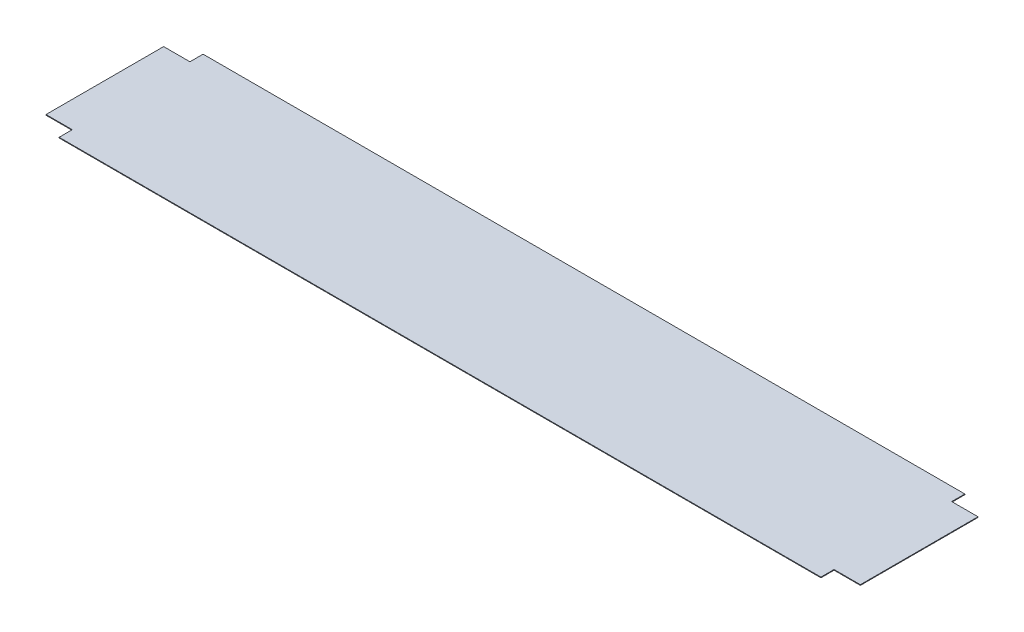
ISO-10303-21;
HEADER;
FILE_DESCRIPTION(('STEP AP214'),'2;1');
FILE_NAME('part.step','',(''),(''),'','','');
FILE_SCHEMA(('AUTOMOTIVE_DESIGN { 1 0 10303 214 1 1 1 1 }'));
ENDSEC;
DATA;
#1=APPLICATION_CONTEXT('core data for automotive mechanical design processes');
#2=APPLICATION_PROTOCOL_DEFINITION('international standard','automotive_design',2000,#1);
#3=PRODUCT_CONTEXT('',#1,'mechanical');
#4=PRODUCT('Part','Part','',(#3));
#5=PRODUCT_RELATED_PRODUCT_CATEGORY('part','',(#4));
#6=PRODUCT_DEFINITION_FORMATION('','',#4);
#7=PRODUCT_DEFINITION_CONTEXT('part definition',#1,'design');
#8=PRODUCT_DEFINITION('design','',#6,#7);
#9=PRODUCT_DEFINITION_SHAPE('','',#8);
#10=(LENGTH_UNIT() NAMED_UNIT(*) SI_UNIT(.MILLI.,.METRE.));
#11=(NAMED_UNIT(*) PLANE_ANGLE_UNIT() SI_UNIT($,.RADIAN.));
#12=(NAMED_UNIT(*) SI_UNIT($,.STERADIAN.) SOLID_ANGLE_UNIT());
#13=UNCERTAINTY_MEASURE_WITH_UNIT(LENGTH_MEASURE(1.E-05),#10,'distance_accuracy_value','');
#14=(GEOMETRIC_REPRESENTATION_CONTEXT(3) GLOBAL_UNCERTAINTY_ASSIGNED_CONTEXT((#13)) GLOBAL_UNIT_ASSIGNED_CONTEXT((#10,
#11,#12)) REPRESENTATION_CONTEXT('',''));
#15=CARTESIAN_POINT('',(0.,0.,0.));
#16=DIRECTION('',(0.,0.,1.));
#17=DIRECTION('',(1.,0.,0.));
#18=AXIS2_PLACEMENT_3D('',#15,#16,#17);
#19=CARTESIAN_POINT('',(-579.5,-1.,-109.5));
#20=DIRECTION('',(0.,0.,-1.));
#21=DIRECTION('',(-1.,0.,0.));
#22=AXIS2_PLACEMENT_3D('',#19,#20,#21);
#23=PLANE('',#22);
#24=DIRECTION('',(-1.,0.,0.));
#25=VECTOR('',#24,1.);
#26=CARTESIAN_POINT('',(-579.5,0.,-109.5));
#27=LINE('',#26,#25);
#28=CARTESIAN_POINT('',(579.5,0.,-109.5));
#29=VERTEX_POINT('',#28);
#30=CARTESIAN_POINT('',(-579.5,0.,-109.5));
#31=VERTEX_POINT('',#30);
#32=EDGE_CURVE('E161',#29,#31,#27,.T.);
#33=ORIENTED_EDGE('',*,*,#32,.F.);
#34=DIRECTION('',(0.,1.,0.));
#35=VECTOR('',#34,1.);
#36=CARTESIAN_POINT('',(579.5,-1.,-109.5));
#37=LINE('',#36,#35);
#38=CARTESIAN_POINT('',(579.5,-1.,-109.5));
#39=VERTEX_POINT('',#38);
#40=EDGE_CURVE('E11',#39,#29,#37,.T.);
#41=ORIENTED_EDGE('',*,*,#40,.F.);
#42=DIRECTION('',(-1.,0.,0.));
#43=VECTOR('',#42,1.);
#44=CARTESIAN_POINT('',(-579.5,-1.,-109.5));
#45=LINE('',#44,#43);
#46=CARTESIAN_POINT('',(-579.5,-1.,-109.5));
#47=VERTEX_POINT('',#46);
#48=EDGE_CURVE('E193',#39,#47,#45,.T.);
#49=ORIENTED_EDGE('',*,*,#48,.T.);
#50=DIRECTION('',(0.,1.,0.));
#51=VECTOR('',#50,1.);
#52=CARTESIAN_POINT('',(-579.5,-1.,-109.5));
#53=LINE('',#52,#51);
#54=EDGE_CURVE('E43',#47,#31,#53,.T.);
#55=ORIENTED_EDGE('',*,*,#54,.T.);
#56=EDGE_LOOP('',(#33,#41,#49,#55));
#57=FACE_BOUND('',#56,.T.);
#58=ADVANCED_FACE('F40',(#57),#23,.T.);
#59=CARTESIAN_POINT('',(579.5,-1.,-109.5));
#60=DIRECTION('',(1.,0.,0.));
#61=DIRECTION('',(0.,0.,-1.));
#62=AXIS2_PLACEMENT_3D('',#59,#60,#61);
#63=PLANE('',#62);
#64=DIRECTION('',(0.,0.,-1.));
#65=VECTOR('',#64,1.);
#66=CARTESIAN_POINT('',(579.5,0.,-109.5));
#67=LINE('',#66,#65);
#68=CARTESIAN_POINT('',(579.5,0.,-89.5000000000004));
#69=VERTEX_POINT('',#68);
#70=EDGE_CURVE('E191',#69,#29,#67,.T.);
#71=ORIENTED_EDGE('',*,*,#70,.F.);
#72=DIRECTION('',(0.,1.,0.));
#73=VECTOR('',#72,1.);
#74=CARTESIAN_POINT('',(579.5,-1.,-89.5000000000004));
#75=LINE('',#74,#73);
#76=CARTESIAN_POINT('',(579.5,-1.,-89.5000000000004));
#77=VERTEX_POINT('',#76);
#78=EDGE_CURVE('E49',#77,#69,#75,.T.);
#79=ORIENTED_EDGE('',*,*,#78,.F.);
#80=DIRECTION('',(0.,0.,-1.));
#81=VECTOR('',#80,1.);
#82=CARTESIAN_POINT('',(579.5,-1.,-109.5));
#83=LINE('',#82,#81);
#84=EDGE_CURVE('E151',#77,#39,#83,.T.);
#85=ORIENTED_EDGE('',*,*,#84,.T.);
#86=ORIENTED_EDGE('',*,*,#40,.T.);
#87=EDGE_LOOP('',(#71,#79,#85,#86));
#88=FACE_BOUND('',#87,.T.);
#89=ADVANCED_FACE('F213',(#88),#63,.T.);
#90=CARTESIAN_POINT('',(579.5,-1.,-89.5000000000004));
#91=DIRECTION('',(0.,0.,-1.));
#92=DIRECTION('',(-1.,0.,0.));
#93=AXIS2_PLACEMENT_3D('',#90,#91,#92);
#94=PLANE('',#93);
#95=DIRECTION('',(-1.,0.,0.));
#96=VECTOR('',#95,1.);
#97=CARTESIAN_POINT('',(579.5,0.,-89.5000000000004));
#98=LINE('',#97,#96);
#99=CARTESIAN_POINT('',(619.5,0.,-89.4999999999996));
#100=VERTEX_POINT('',#99);
#101=EDGE_CURVE('E138',#100,#69,#98,.T.);
#102=ORIENTED_EDGE('',*,*,#101,.F.);
#103=DIRECTION('',(0.,1.,0.));
#104=VECTOR('',#103,1.);
#105=CARTESIAN_POINT('',(619.5,-1.,-89.4999999999996));
#106=LINE('',#105,#104);
#107=CARTESIAN_POINT('',(619.5,-1.,-89.4999999999996));
#108=VERTEX_POINT('',#107);
#109=EDGE_CURVE('E133',#108,#100,#106,.T.);
#110=ORIENTED_EDGE('',*,*,#109,.F.);
#111=DIRECTION('',(-1.,0.,0.));
#112=VECTOR('',#111,1.);
#113=CARTESIAN_POINT('',(579.5,-1.,-89.5000000000004));
#114=LINE('',#113,#112);
#115=EDGE_CURVE('E136',#108,#77,#114,.T.);
#116=ORIENTED_EDGE('',*,*,#115,.T.);
#117=ORIENTED_EDGE('',*,*,#78,.T.);
#118=EDGE_LOOP('',(#102,#110,#116,#117));
#119=FACE_BOUND('',#118,.T.);
#120=ADVANCED_FACE('F135',(#119),#94,.T.);
#121=CARTESIAN_POINT('',(619.5,-1.,89.4999999999999));
#122=DIRECTION('',(1.,0.,0.));
#123=DIRECTION('',(0.,0.,-1.));
#124=AXIS2_PLACEMENT_3D('',#121,#122,#123);
#125=PLANE('',#124);
#126=DIRECTION('',(0.,0.,-1.));
#127=VECTOR('',#126,1.);
#128=CARTESIAN_POINT('',(619.5,0.,89.4999999999999));
#129=LINE('',#128,#127);
#130=CARTESIAN_POINT('',(619.5,0.,89.4999999999999));
#131=VERTEX_POINT('',#130);
#132=EDGE_CURVE('E188',#131,#100,#129,.T.);
#133=ORIENTED_EDGE('',*,*,#132,.F.);
#134=DIRECTION('',(0.,1.,0.));
#135=VECTOR('',#134,1.);
#136=CARTESIAN_POINT('',(619.5,-1.,89.4999999999999));
#137=LINE('',#136,#135);
#138=CARTESIAN_POINT('',(619.5,-1.,89.4999999999999));
#139=VERTEX_POINT('',#138);
#140=EDGE_CURVE('E143',#139,#131,#137,.T.);
#141=ORIENTED_EDGE('',*,*,#140,.F.);
#142=DIRECTION('',(0.,0.,-1.));
#143=VECTOR('',#142,1.);
#144=CARTESIAN_POINT('',(619.5,-1.,89.4999999999999));
#145=LINE('',#144,#143);
#146=EDGE_CURVE('E149',#139,#108,#145,.T.);
#147=ORIENTED_EDGE('',*,*,#146,.T.);
#148=ORIENTED_EDGE('',*,*,#109,.T.);
#149=EDGE_LOOP('',(#133,#141,#147,#148));
#150=FACE_BOUND('',#149,.T.);
#151=ADVANCED_FACE('F153',(#150),#125,.T.);
#152=CARTESIAN_POINT('',(579.5,-1.,89.4999999999999));
#153=DIRECTION('',(0.,0.,1.));
#154=DIRECTION('',(1.,0.,0.));
#155=AXIS2_PLACEMENT_3D('',#152,#153,#154);
#156=PLANE('',#155);
#157=DIRECTION('',(1.,0.,0.));
#158=VECTOR('',#157,1.);
#159=CARTESIAN_POINT('',(579.5,0.,89.4999999999999));
#160=LINE('',#159,#158);
#161=CARTESIAN_POINT('',(579.5,0.,89.4999999999999));
#162=VERTEX_POINT('',#161);
#163=EDGE_CURVE('E185',#162,#131,#160,.T.);
#164=ORIENTED_EDGE('',*,*,#163,.F.);
#165=DIRECTION('',(0.,1.,0.));
#166=VECTOR('',#165,1.);
#167=CARTESIAN_POINT('',(579.5,-1.,89.4999999999999));
#168=LINE('',#167,#166);
#169=CARTESIAN_POINT('',(579.5,-1.,89.4999999999999));
#170=VERTEX_POINT('',#169);
#171=EDGE_CURVE('E197',#170,#162,#168,.T.);
#172=ORIENTED_EDGE('',*,*,#171,.F.);
#173=DIRECTION('',(1.,0.,0.));
#174=VECTOR('',#173,1.);
#175=CARTESIAN_POINT('',(579.5,-1.,89.4999999999999));
#176=LINE('',#175,#174);
#177=EDGE_CURVE('E154',#170,#139,#176,.T.);
#178=ORIENTED_EDGE('',*,*,#177,.T.);
#179=ORIENTED_EDGE('',*,*,#140,.T.);
#180=EDGE_LOOP('',(#164,#172,#178,#179));
#181=FACE_BOUND('',#180,.T.);
#182=ADVANCED_FACE('F226',(#181),#156,.T.);
#183=CARTESIAN_POINT('',(579.5,-1.,109.5));
#184=DIRECTION('',(1.,0.,0.));
#185=DIRECTION('',(0.,0.,-1.));
#186=AXIS2_PLACEMENT_3D('',#183,#184,#185);
#187=PLANE('',#186);
#188=DIRECTION('',(0.,0.,-1.));
#189=VECTOR('',#188,1.);
#190=CARTESIAN_POINT('',(579.5,0.,109.5));
#191=LINE('',#190,#189);
#192=CARTESIAN_POINT('',(579.5,0.,109.5));
#193=VERTEX_POINT('',#192);
#194=EDGE_CURVE('E182',#193,#162,#191,.T.);
#195=ORIENTED_EDGE('',*,*,#194,.F.);
#196=DIRECTION('',(0.,1.,0.));
#197=VECTOR('',#196,1.);
#198=CARTESIAN_POINT('',(579.5,-1.,109.5));
#199=LINE('',#198,#197);
#200=CARTESIAN_POINT('',(579.5,-1.,109.5));
#201=VERTEX_POINT('',#200);
#202=EDGE_CURVE('E199',#201,#193,#199,.T.);
#203=ORIENTED_EDGE('',*,*,#202,.F.);
#204=DIRECTION('',(0.,0.,-1.));
#205=VECTOR('',#204,1.);
#206=CARTESIAN_POINT('',(579.5,-1.,109.5));
#207=LINE('',#206,#205);
#208=EDGE_CURVE('E156',#201,#170,#207,.T.);
#209=ORIENTED_EDGE('',*,*,#208,.T.);
#210=ORIENTED_EDGE('',*,*,#171,.T.);
#211=EDGE_LOOP('',(#195,#203,#209,#210));
#212=FACE_BOUND('',#211,.T.);
#213=ADVANCED_FACE('F229',(#212),#187,.T.);
#214=CARTESIAN_POINT('',(-579.5,-1.,109.5));
#215=DIRECTION('',(0.,0.,1.));
#216=DIRECTION('',(1.,0.,0.));
#217=AXIS2_PLACEMENT_3D('',#214,#215,#216);
#218=PLANE('',#217);
#219=DIRECTION('',(1.,0.,0.));
#220=VECTOR('',#219,1.);
#221=CARTESIAN_POINT('',(-579.5,0.,109.5));
#222=LINE('',#221,#220);
#223=CARTESIAN_POINT('',(-579.5,0.,109.5));
#224=VERTEX_POINT('',#223);
#225=EDGE_CURVE('E179',#224,#193,#222,.T.);
#226=ORIENTED_EDGE('',*,*,#225,.F.);
#227=DIRECTION('',(0.,1.,0.));
#228=VECTOR('',#227,1.);
#229=CARTESIAN_POINT('',(-579.5,-1.,109.5));
#230=LINE('',#229,#228);
#231=CARTESIAN_POINT('',(-579.5,-1.,109.5));
#232=VERTEX_POINT('',#231);
#233=EDGE_CURVE('E201',#232,#224,#230,.T.);
#234=ORIENTED_EDGE('',*,*,#233,.F.);
#235=DIRECTION('',(1.,0.,0.));
#236=VECTOR('',#235,1.);
#237=CARTESIAN_POINT('',(-579.5,-1.,109.5));
#238=LINE('',#237,#236);
#239=EDGE_CURVE('E383',#232,#201,#238,.T.);
#240=ORIENTED_EDGE('',*,*,#239,.T.);
#241=ORIENTED_EDGE('',*,*,#202,.T.);
#242=EDGE_LOOP('',(#226,#234,#240,#241));
#243=FACE_BOUND('',#242,.T.);
#244=ADVANCED_FACE('F233',(#243),#218,.T.);
#245=CARTESIAN_POINT('',(-579.5,-1.,109.5));
#246=DIRECTION('',(-1.,0.,0.));
#247=DIRECTION('',(0.,0.,1.));
#248=AXIS2_PLACEMENT_3D('',#245,#246,#247);
#249=PLANE('',#248);
#250=DIRECTION('',(0.,0.,1.));
#251=VECTOR('',#250,1.);
#252=CARTESIAN_POINT('',(-579.5,0.,109.5));
#253=LINE('',#252,#251);
#254=CARTESIAN_POINT('',(-579.5,0.,89.4999999999999));
#255=VERTEX_POINT('',#254);
#256=EDGE_CURVE('E176',#255,#224,#253,.T.);
#257=ORIENTED_EDGE('',*,*,#256,.F.);
#258=DIRECTION('',(0.,1.,0.));
#259=VECTOR('',#258,1.);
#260=CARTESIAN_POINT('',(-579.5,-1.,89.4999999999999));
#261=LINE('',#260,#259);
#262=CARTESIAN_POINT('',(-579.5,-1.,89.4999999999999));
#263=VERTEX_POINT('',#262);
#264=EDGE_CURVE('E203',#263,#255,#261,.T.);
#265=ORIENTED_EDGE('',*,*,#264,.F.);
#266=DIRECTION('',(0.,0.,1.));
#267=VECTOR('',#266,1.);
#268=CARTESIAN_POINT('',(-579.5,-1.,109.5));
#269=LINE('',#268,#267);
#270=EDGE_CURVE('E387',#263,#232,#269,.T.);
#271=ORIENTED_EDGE('',*,*,#270,.T.);
#272=ORIENTED_EDGE('',*,*,#233,.T.);
#273=EDGE_LOOP('',(#257,#265,#271,#272));
#274=FACE_BOUND('',#273,.T.);
#275=ADVANCED_FACE('F237',(#274),#249,.T.);
#276=CARTESIAN_POINT('',(-579.5,-1.,89.4999999999999));
#277=DIRECTION('',(0.,0.,1.));
#278=DIRECTION('',(1.,0.,0.));
#279=AXIS2_PLACEMENT_3D('',#276,#277,#278);
#280=PLANE('',#279);
#281=DIRECTION('',(1.,0.,0.));
#282=VECTOR('',#281,1.);
#283=CARTESIAN_POINT('',(-579.5,0.,89.4999999999999));
#284=LINE('',#283,#282);
#285=CARTESIAN_POINT('',(-619.5,0.,89.4999999999999));
#286=VERTEX_POINT('',#285);
#287=EDGE_CURVE('E173',#286,#255,#284,.T.);
#288=ORIENTED_EDGE('',*,*,#287,.F.);
#289=DIRECTION('',(0.,1.,0.));
#290=VECTOR('',#289,1.);
#291=CARTESIAN_POINT('',(-619.5,-1.,89.4999999999999));
#292=LINE('',#291,#290);
#293=CARTESIAN_POINT('',(-619.5,-1.,89.4999999999999));
#294=VERTEX_POINT('',#293);
#295=EDGE_CURVE('E205',#294,#286,#292,.T.);
#296=ORIENTED_EDGE('',*,*,#295,.F.);
#297=DIRECTION('',(1.,0.,0.));
#298=VECTOR('',#297,1.);
#299=CARTESIAN_POINT('',(-579.5,-1.,89.4999999999999));
#300=LINE('',#299,#298);
#301=EDGE_CURVE('E376',#294,#263,#300,.T.);
#302=ORIENTED_EDGE('',*,*,#301,.T.);
#303=ORIENTED_EDGE('',*,*,#264,.T.);
#304=EDGE_LOOP('',(#288,#296,#302,#303));
#305=FACE_BOUND('',#304,.T.);
#306=ADVANCED_FACE('F241',(#305),#280,.T.);
#307=CARTESIAN_POINT('',(-619.5,-1.,89.4999999999999));
#308=DIRECTION('',(-1.,0.,0.));
#309=DIRECTION('',(0.,0.,1.));
#310=AXIS2_PLACEMENT_3D('',#307,#308,#309);
#311=PLANE('',#310);
#312=DIRECTION('',(0.,0.,1.));
#313=VECTOR('',#312,1.);
#314=CARTESIAN_POINT('',(-619.5,0.,89.4999999999999));
#315=LINE('',#314,#313);
#316=CARTESIAN_POINT('',(-619.5,0.,-89.4999999999996));
#317=VERTEX_POINT('',#316);
#318=EDGE_CURVE('E170',#317,#286,#315,.T.);
#319=ORIENTED_EDGE('',*,*,#318,.F.);
#320=DIRECTION('',(0.,1.,0.));
#321=VECTOR('',#320,1.);
#322=CARTESIAN_POINT('',(-619.5,-1.,-89.4999999999996));
#323=LINE('',#322,#321);
#324=CARTESIAN_POINT('',(-619.5,-1.,-89.4999999999996));
#325=VERTEX_POINT('',#324);
#326=EDGE_CURVE('E207',#325,#317,#323,.T.);
#327=ORIENTED_EDGE('',*,*,#326,.F.);
#328=DIRECTION('',(0.,0.,1.));
#329=VECTOR('',#328,1.);
#330=CARTESIAN_POINT('',(-619.5,-1.,89.4999999999999));
#331=LINE('',#330,#329);
#332=EDGE_CURVE('E372',#325,#294,#331,.T.);
#333=ORIENTED_EDGE('',*,*,#332,.T.);
#334=ORIENTED_EDGE('',*,*,#295,.T.);
#335=EDGE_LOOP('',(#319,#327,#333,#334));
#336=FACE_BOUND('',#335,.T.);
#337=ADVANCED_FACE('F245',(#336),#311,.T.);
#338=CARTESIAN_POINT('',(-579.5,-1.,-89.4999999999996));
#339=DIRECTION('',(0.,0.,-1.));
#340=DIRECTION('',(-1.,0.,0.));
#341=AXIS2_PLACEMENT_3D('',#338,#339,#340);
#342=PLANE('',#341);
#343=DIRECTION('',(-1.,0.,0.));
#344=VECTOR('',#343,1.);
#345=CARTESIAN_POINT('',(-579.5,0.,-89.4999999999996));
#346=LINE('',#345,#344);
#347=CARTESIAN_POINT('',(-579.5,0.,-89.4999999999996));
#348=VERTEX_POINT('',#347);
#349=EDGE_CURVE('E167',#348,#317,#346,.T.);
#350=ORIENTED_EDGE('',*,*,#349,.F.);
#351=DIRECTION('',(0.,1.,0.));
#352=VECTOR('',#351,1.);
#353=CARTESIAN_POINT('',(-579.5,-1.,-89.4999999999996));
#354=LINE('',#353,#352);
#355=CARTESIAN_POINT('',(-579.5,-1.,-89.4999999999996));
#356=VERTEX_POINT('',#355);
#357=EDGE_CURVE('E208',#356,#348,#354,.T.);
#358=ORIENTED_EDGE('',*,*,#357,.F.);
#359=DIRECTION('',(-1.,0.,0.));
#360=VECTOR('',#359,1.);
#361=CARTESIAN_POINT('',(-579.5,-1.,-89.4999999999996));
#362=LINE('',#361,#360);
#363=EDGE_CURVE('E393',#356,#325,#362,.T.);
#364=ORIENTED_EDGE('',*,*,#363,.T.);
#365=ORIENTED_EDGE('',*,*,#326,.T.);
#366=EDGE_LOOP('',(#350,#358,#364,#365));
#367=FACE_BOUND('',#366,.T.);
#368=ADVANCED_FACE('F249',(#367),#342,.T.);
#369=CARTESIAN_POINT('',(-579.5,-1.,-109.5));
#370=DIRECTION('',(-1.,0.,0.));
#371=DIRECTION('',(0.,0.,1.));
#372=AXIS2_PLACEMENT_3D('',#369,#370,#371);
#373=PLANE('',#372);
#374=DIRECTION('',(0.,0.,1.));
#375=VECTOR('',#374,1.);
#376=CARTESIAN_POINT('',(-579.5,0.,-109.5));
#377=LINE('',#376,#375);
#378=EDGE_CURVE('E164',#31,#348,#377,.T.);
#379=ORIENTED_EDGE('',*,*,#378,.F.);
#380=ORIENTED_EDGE('',*,*,#54,.F.);
#381=DIRECTION('',(0.,0.,1.));
#382=VECTOR('',#381,1.);
#383=CARTESIAN_POINT('',(-579.5,-1.,-109.5));
#384=LINE('',#383,#382);
#385=EDGE_CURVE('E395',#47,#356,#384,.T.);
#386=ORIENTED_EDGE('',*,*,#385,.T.);
#387=ORIENTED_EDGE('',*,*,#357,.T.);
#388=EDGE_LOOP('',(#379,#380,#386,#387));
#389=FACE_BOUND('',#388,.T.);
#390=ADVANCED_FACE('F210',(#389),#373,.T.);
#391=CARTESIAN_POINT('',(0.,-1.,0.));
#392=DIRECTION('',(0.,-1.,0.));
#393=DIRECTION('',(0.,0.,-1.));
#394=AXIS2_PLACEMENT_3D('',#391,#392,#393);
#395=PLANE('',#394);
#396=ORIENTED_EDGE('',*,*,#48,.F.);
#397=ORIENTED_EDGE('',*,*,#84,.F.);
#398=ORIENTED_EDGE('',*,*,#115,.F.);
#399=ORIENTED_EDGE('',*,*,#146,.F.);
#400=ORIENTED_EDGE('',*,*,#177,.F.);
#401=ORIENTED_EDGE('',*,*,#208,.F.);
#402=ORIENTED_EDGE('',*,*,#239,.F.);
#403=ORIENTED_EDGE('',*,*,#270,.F.);
#404=ORIENTED_EDGE('',*,*,#301,.F.);
#405=ORIENTED_EDGE('',*,*,#332,.F.);
#406=ORIENTED_EDGE('',*,*,#363,.F.);
#407=ORIENTED_EDGE('',*,*,#385,.F.);
#408=EDGE_LOOP('',(#396,#397,#398,#399,#400,#401,#402,#403,#404,#405,#406,#407));
#409=FACE_BOUND('',#408,.T.);
#410=ADVANCED_FACE('F147',(#409),#395,.T.);
#411=CARTESIAN_POINT('',(0.,0.,0.));
#412=DIRECTION('',(0.,-1.,0.));
#413=DIRECTION('',(0.,0.,-1.));
#414=AXIS2_PLACEMENT_3D('',#411,#412,#413);
#415=PLANE('',#414);
#416=ORIENTED_EDGE('',*,*,#32,.T.);
#417=ORIENTED_EDGE('',*,*,#378,.T.);
#418=ORIENTED_EDGE('',*,*,#349,.T.);
#419=ORIENTED_EDGE('',*,*,#318,.T.);
#420=ORIENTED_EDGE('',*,*,#287,.T.);
#421=ORIENTED_EDGE('',*,*,#256,.T.);
#422=ORIENTED_EDGE('',*,*,#225,.T.);
#423=ORIENTED_EDGE('',*,*,#194,.T.);
#424=ORIENTED_EDGE('',*,*,#163,.T.);
#425=ORIENTED_EDGE('',*,*,#132,.T.);
#426=ORIENTED_EDGE('',*,*,#101,.T.);
#427=ORIENTED_EDGE('',*,*,#70,.T.);
#428=EDGE_LOOP('',(#416,#417,#418,#419,#420,#421,#422,#423,#424,#425,#426,#427));
#429=FACE_BOUND('',#428,.T.);
#430=ADVANCED_FACE('F212',(#429),#415,.F.);
#431=CLOSED_SHELL('',(#58,#89,#120,#151,#182,#213,#244,#275,#306,#337,#368,#390,#410,#430));
#432=MANIFOLD_SOLID_BREP('B2',#431);
#433=ADVANCED_BREP_SHAPE_REPRESENTATION('',(#18,#432),#14);
#434=SHAPE_DEFINITION_REPRESENTATION(#9,#433);
ENDSEC;
END-ISO-10303-21;
